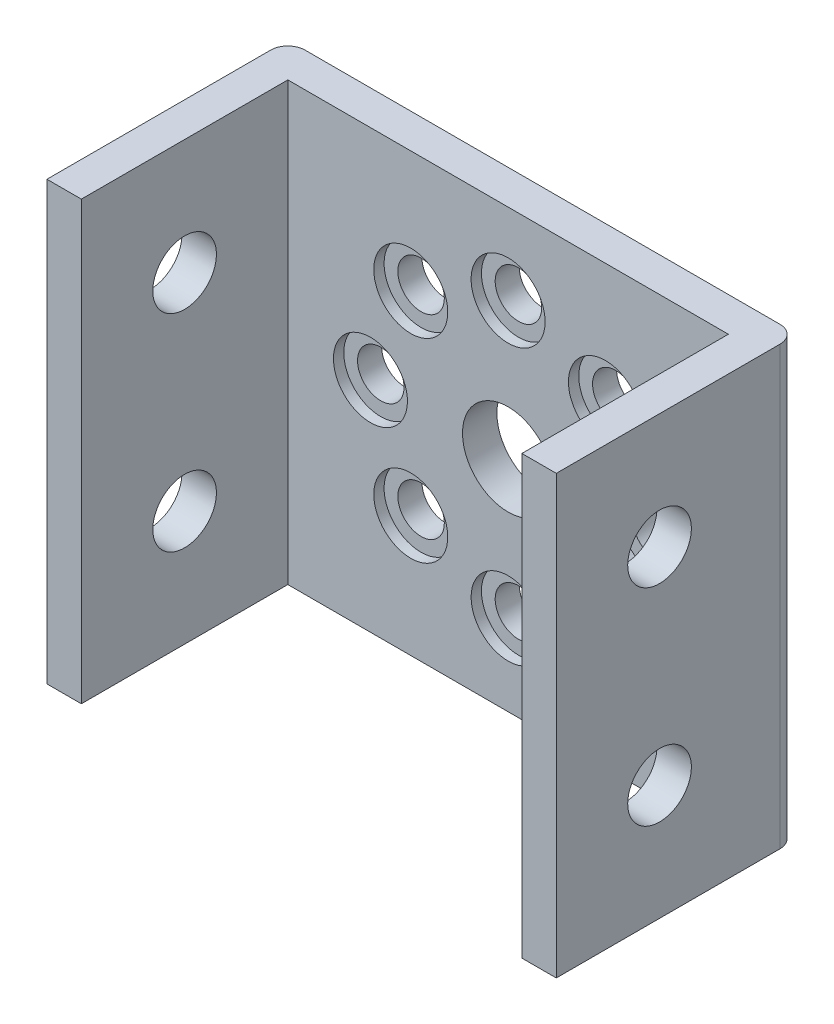
ISO-10303-21;
HEADER;
FILE_DESCRIPTION(('STEP AP214'),'2;1');
FILE_NAME('part.step','',(''),(''),'','','');
FILE_SCHEMA(('AUTOMOTIVE_DESIGN { 1 0 10303 214 1 1 1 1 }'));
ENDSEC;
DATA;
#1=APPLICATION_CONTEXT('core data for automotive mechanical design processes');
#2=APPLICATION_PROTOCOL_DEFINITION('international standard','automotive_design',2000,#1);
#3=PRODUCT_CONTEXT('',#1,'mechanical');
#4=PRODUCT('Part','Part','',(#3));
#5=PRODUCT_RELATED_PRODUCT_CATEGORY('part','',(#4));
#6=PRODUCT_DEFINITION_FORMATION('','',#4);
#7=PRODUCT_DEFINITION_CONTEXT('part definition',#1,'design');
#8=PRODUCT_DEFINITION('design','',#6,#7);
#9=PRODUCT_DEFINITION_SHAPE('','',#8);
#10=(LENGTH_UNIT() NAMED_UNIT(*) SI_UNIT(.MILLI.,.METRE.));
#11=(NAMED_UNIT(*) PLANE_ANGLE_UNIT() SI_UNIT($,.RADIAN.));
#12=(NAMED_UNIT(*) SI_UNIT($,.STERADIAN.) SOLID_ANGLE_UNIT());
#13=UNCERTAINTY_MEASURE_WITH_UNIT(LENGTH_MEASURE(1.E-05),#10,'distance_accuracy_value','');
#14=(GEOMETRIC_REPRESENTATION_CONTEXT(3) GLOBAL_UNCERTAINTY_ASSIGNED_CONTEXT((#13)) GLOBAL_UNIT_ASSIGNED_CONTEXT((#10,
#11,#12)) REPRESENTATION_CONTEXT('',''));
#15=CARTESIAN_POINT('',(0.,0.,0.));
#16=DIRECTION('',(0.,0.,1.));
#17=DIRECTION('',(1.,0.,0.));
#18=AXIS2_PLACEMENT_3D('',#15,#16,#17);
#19=CARTESIAN_POINT('',(-5.65685424949231,5.65685424949245,0.));
#20=DIRECTION('',(0.,0.,1.));
#21=DIRECTION('',(1.,0.,0.));
#22=AXIS2_PLACEMENT_3D('',#19,#20,#21);
#23=CYLINDRICAL_SURFACE('',#22,1.35);
#24=CARTESIAN_POINT('',(-5.65685424949231,5.65685424949245,0.));
#25=DIRECTION('',(0.,0.,1.));
#26=DIRECTION('',(0.707106781186556,0.707106781186539,0.));
#27=AXIS2_PLACEMENT_3D('',#24,#25,#26);
#28=CIRCLE('',#27,1.35);
#29=CARTESIAN_POINT('',(-4.70226009489046,6.61144840409428,0.));
#30=VERTEX_POINT('',#29);
#31=EDGE_CURVE('E148',#30,#30,#28,.T.);
#32=ORIENTED_EDGE('',*,*,#31,.F.);
#33=EDGE_LOOP('',(#32));
#34=FACE_BOUND('',#33,.T.);
#35=CARTESIAN_POINT('',(-5.65685424949231,5.65685424949245,1.40000000000001));
#36=DIRECTION('',(0.,0.,1.));
#37=DIRECTION('',(1.,0.,0.));
#38=AXIS2_PLACEMENT_3D('',#35,#36,#37);
#39=CIRCLE('',#38,1.35);
#40=CARTESIAN_POINT('',(-4.30685424949231,5.65685424949245,1.40000000000001));
#41=VERTEX_POINT('',#40);
#42=EDGE_CURVE('E175',#41,#41,#39,.F.);
#43=ORIENTED_EDGE('',*,*,#42,.F.);
#44=EDGE_LOOP('',(#43));
#45=FACE_BOUND('',#44,.T.);
#46=ADVANCED_FACE('F32',(#34,#45),#23,.F.);
#47=CARTESIAN_POINT('',(-8.,0.,0.));
#48=DIRECTION('',(0.,0.,1.));
#49=DIRECTION('',(1.,0.,0.));
#50=AXIS2_PLACEMENT_3D('',#47,#48,#49);
#51=CYLINDRICAL_SURFACE('',#50,1.35);
#52=CARTESIAN_POINT('',(-8.,0.,0.));
#53=DIRECTION('',(0.,0.,1.));
#54=DIRECTION('',(0.,1.,0.));
#55=AXIS2_PLACEMENT_3D('',#52,#53,#54);
#56=CIRCLE('',#55,1.35);
#57=CARTESIAN_POINT('',(-7.99999999999999,1.35000000000008,0.));
#58=VERTEX_POINT('',#57);
#59=EDGE_CURVE('E300',#58,#58,#56,.T.);
#60=ORIENTED_EDGE('',*,*,#59,.F.);
#61=EDGE_LOOP('',(#60));
#62=FACE_BOUND('',#61,.T.);
#63=CARTESIAN_POINT('',(-8.,0.,1.40000000000001));
#64=DIRECTION('',(0.,0.,1.));
#65=DIRECTION('',(1.,0.,0.));
#66=AXIS2_PLACEMENT_3D('',#63,#64,#65);
#67=CIRCLE('',#66,1.35);
#68=CARTESIAN_POINT('',(-6.65,0.,1.40000000000001));
#69=VERTEX_POINT('',#68);
#70=EDGE_CURVE('E170',#69,#69,#67,.F.);
#71=ORIENTED_EDGE('',*,*,#70,.F.);
#72=EDGE_LOOP('',(#71));
#73=FACE_BOUND('',#72,.T.);
#74=ADVANCED_FACE('F383',(#62,#73),#51,.F.);
#75=CARTESIAN_POINT('',(-5.65685424949243,-5.65685424949233,0.));
#76=DIRECTION('',(0.,0.,1.));
#77=DIRECTION('',(1.,0.,0.));
#78=AXIS2_PLACEMENT_3D('',#75,#76,#77);
#79=CYLINDRICAL_SURFACE('',#78,1.35);
#80=CARTESIAN_POINT('',(-5.65685424949243,-5.65685424949233,0.));
#81=DIRECTION('',(0.,0.,1.));
#82=DIRECTION('',(-0.707106781186541,0.707106781186554,0.));
#83=AXIS2_PLACEMENT_3D('',#80,#81,#82);
#84=CIRCLE('',#83,1.35);
#85=CARTESIAN_POINT('',(-6.61144840409426,-4.70226009489048,0.));
#86=VERTEX_POINT('',#85);
#87=EDGE_CURVE('E297',#86,#86,#84,.T.);
#88=ORIENTED_EDGE('',*,*,#87,.F.);
#89=EDGE_LOOP('',(#88));
#90=FACE_BOUND('',#89,.T.);
#91=CARTESIAN_POINT('',(-5.65685424949243,-5.65685424949233,1.40000000000001));
#92=DIRECTION('',(0.,0.,1.));
#93=DIRECTION('',(1.,0.,0.));
#94=AXIS2_PLACEMENT_3D('',#91,#92,#93);
#95=CIRCLE('',#94,1.35);
#96=CARTESIAN_POINT('',(-4.30685424949243,-5.65685424949233,1.40000000000001));
#97=VERTEX_POINT('',#96);
#98=EDGE_CURVE('E165',#97,#97,#95,.F.);
#99=ORIENTED_EDGE('',*,*,#98,.F.);
#100=EDGE_LOOP('',(#99));
#101=FACE_BOUND('',#100,.T.);
#102=ADVANCED_FACE('F389',(#90,#101),#79,.F.);
#103=CARTESIAN_POINT('',(0.,-8.,0.));
#104=DIRECTION('',(0.,0.,1.));
#105=DIRECTION('',(1.,0.,0.));
#106=AXIS2_PLACEMENT_3D('',#103,#104,#105);
#107=CYLINDRICAL_SURFACE('',#106,1.35);
#108=CARTESIAN_POINT('',(0.,-8.,0.));
#109=DIRECTION('',(0.,0.,1.));
#110=DIRECTION('',(-1.,0.,0.));
#111=AXIS2_PLACEMENT_3D('',#108,#109,#110);
#112=CIRCLE('',#111,1.35);
#113=CARTESIAN_POINT('',(-1.35,-8.,0.));
#114=VERTEX_POINT('',#113);
#115=EDGE_CURVE('E294',#114,#114,#112,.T.);
#116=ORIENTED_EDGE('',*,*,#115,.F.);
#117=EDGE_LOOP('',(#116));
#118=FACE_BOUND('',#117,.T.);
#119=CARTESIAN_POINT('',(0.,-8.,1.40000000000001));
#120=DIRECTION('',(0.,0.,1.));
#121=DIRECTION('',(1.,0.,0.));
#122=AXIS2_PLACEMENT_3D('',#119,#120,#121);
#123=CIRCLE('',#122,1.35);
#124=CARTESIAN_POINT('',(1.35,-8.,1.40000000000001));
#125=VERTEX_POINT('',#124);
#126=EDGE_CURVE('E160',#125,#125,#123,.F.);
#127=ORIENTED_EDGE('',*,*,#126,.F.);
#128=EDGE_LOOP('',(#127));
#129=FACE_BOUND('',#128,.T.);
#130=ADVANCED_FACE('F400',(#118,#129),#107,.F.);
#131=CARTESIAN_POINT('',(5.65685424949235,-5.65685424949241,0.));
#132=DIRECTION('',(0.,0.,1.));
#133=DIRECTION('',(1.,0.,0.));
#134=AXIS2_PLACEMENT_3D('',#131,#132,#133);
#135=CYLINDRICAL_SURFACE('',#134,1.35);
#136=CARTESIAN_POINT('',(5.65685424949235,-5.65685424949241,0.));
#137=DIRECTION('',(0.,0.,1.));
#138=DIRECTION('',(-0.707106781186551,-0.707106781186544,0.));
#139=AXIS2_PLACEMENT_3D('',#136,#137,#138);
#140=CIRCLE('',#139,1.35);
#141=CARTESIAN_POINT('',(4.70226009489051,-6.61144840409424,0.));
#142=VERTEX_POINT('',#141);
#143=EDGE_CURVE('E291',#142,#142,#140,.T.);
#144=ORIENTED_EDGE('',*,*,#143,.F.);
#145=EDGE_LOOP('',(#144));
#146=FACE_BOUND('',#145,.T.);
#147=CARTESIAN_POINT('',(5.65685424949235,-5.65685424949241,1.40000000000001));
#148=DIRECTION('',(0.,0.,1.));
#149=DIRECTION('',(1.,0.,0.));
#150=AXIS2_PLACEMENT_3D('',#147,#148,#149);
#151=CIRCLE('',#150,1.35);
#152=CARTESIAN_POINT('',(7.00685424949235,-5.65685424949241,1.40000000000001));
#153=VERTEX_POINT('',#152);
#154=EDGE_CURVE('E155',#153,#153,#151,.F.);
#155=ORIENTED_EDGE('',*,*,#154,.F.);
#156=EDGE_LOOP('',(#155));
#157=FACE_BOUND('',#156,.T.);
#158=ADVANCED_FACE('F404',(#146,#157),#135,.F.);
#159=CARTESIAN_POINT('',(8.,0.,0.));
#160=DIRECTION('',(0.,0.,1.));
#161=DIRECTION('',(1.,0.,0.));
#162=AXIS2_PLACEMENT_3D('',#159,#160,#161);
#163=CYLINDRICAL_SURFACE('',#162,1.35);
#164=CARTESIAN_POINT('',(8.,0.,0.));
#165=DIRECTION('',(0.,0.,1.));
#166=DIRECTION('',(0.,-1.,0.));
#167=AXIS2_PLACEMENT_3D('',#164,#165,#166);
#168=CIRCLE('',#167,1.35);
#169=CARTESIAN_POINT('',(7.99999999999999,-1.35000000000003,0.));
#170=VERTEX_POINT('',#169);
#171=EDGE_CURVE('E288',#170,#170,#168,.T.);
#172=ORIENTED_EDGE('',*,*,#171,.F.);
#173=EDGE_LOOP('',(#172));
#174=FACE_BOUND('',#173,.T.);
#175=CARTESIAN_POINT('',(8.,0.,1.40000000000001));
#176=DIRECTION('',(0.,0.,1.));
#177=DIRECTION('',(1.,0.,0.));
#178=AXIS2_PLACEMENT_3D('',#175,#176,#177);
#179=CIRCLE('',#178,1.35);
#180=CARTESIAN_POINT('',(9.35,0.,1.40000000000001));
#181=VERTEX_POINT('',#180);
#182=EDGE_CURVE('E150',#181,#181,#179,.F.);
#183=ORIENTED_EDGE('',*,*,#182,.F.);
#184=EDGE_LOOP('',(#183));
#185=FACE_BOUND('',#184,.T.);
#186=ADVANCED_FACE('F408',(#174,#185),#163,.F.);
#187=CARTESIAN_POINT('',(5.65685424949239,5.65685424949237,0.));
#188=DIRECTION('',(0.,0.,1.));
#189=DIRECTION('',(1.,0.,0.));
#190=AXIS2_PLACEMENT_3D('',#187,#188,#189);
#191=CYLINDRICAL_SURFACE('',#190,1.35);
#192=CARTESIAN_POINT('',(5.65685424949239,5.65685424949237,0.));
#193=DIRECTION('',(0.,0.,1.));
#194=DIRECTION('',(0.707106781186546,-0.707106781186549,0.));
#195=AXIS2_PLACEMENT_3D('',#192,#193,#194);
#196=CIRCLE('',#195,1.35);
#197=CARTESIAN_POINT('',(6.61144840409423,4.70226009489053,0.));
#198=VERTEX_POINT('',#197);
#199=EDGE_CURVE('E283',#198,#198,#196,.T.);
#200=ORIENTED_EDGE('',*,*,#199,.F.);
#201=EDGE_LOOP('',(#200));
#202=FACE_BOUND('',#201,.T.);
#203=CARTESIAN_POINT('',(5.65685424949239,5.65685424949237,1.40000000000001));
#204=DIRECTION('',(0.,0.,1.));
#205=DIRECTION('',(1.,0.,0.));
#206=AXIS2_PLACEMENT_3D('',#203,#204,#205);
#207=CIRCLE('',#206,1.35);
#208=CARTESIAN_POINT('',(7.00685424949239,5.65685424949237,1.40000000000001));
#209=VERTEX_POINT('',#208);
#210=EDGE_CURVE('E145',#209,#209,#207,.F.);
#211=ORIENTED_EDGE('',*,*,#210,.F.);
#212=EDGE_LOOP('',(#211));
#213=FACE_BOUND('',#212,.T.);
#214=ADVANCED_FACE('F412',(#202,#213),#191,.F.);
#215=CARTESIAN_POINT('',(0.,8.,0.));
#216=DIRECTION('',(0.,0.,1.));
#217=DIRECTION('',(1.,0.,0.));
#218=AXIS2_PLACEMENT_3D('',#215,#216,#217);
#219=CYLINDRICAL_SURFACE('',#218,1.35);
#220=CARTESIAN_POINT('',(0.,8.,0.));
#221=DIRECTION('',(0.,0.,1.));
#222=DIRECTION('',(1.,0.,0.));
#223=AXIS2_PLACEMENT_3D('',#220,#221,#222);
#224=CIRCLE('',#223,1.35);
#225=CARTESIAN_POINT('',(1.35,8.,0.));
#226=VERTEX_POINT('',#225);
#227=EDGE_CURVE('E143',#226,#226,#224,.T.);
#228=ORIENTED_EDGE('',*,*,#227,.F.);
#229=EDGE_LOOP('',(#228));
#230=FACE_BOUND('',#229,.T.);
#231=CARTESIAN_POINT('',(0.,8.,1.40000000000001));
#232=DIRECTION('',(0.,0.,1.));
#233=DIRECTION('',(1.,0.,0.));
#234=AXIS2_PLACEMENT_3D('',#231,#232,#233);
#235=CIRCLE('',#234,1.35);
#236=CARTESIAN_POINT('',(1.35,8.,1.40000000000001));
#237=VERTEX_POINT('',#236);
#238=EDGE_CURVE('E140',#237,#237,#235,.F.);
#239=ORIENTED_EDGE('',*,*,#238,.F.);
#240=EDGE_LOOP('',(#239));
#241=FACE_BOUND('',#240,.T.);
#242=ADVANCED_FACE('F415',(#230,#241),#219,.F.);
#243=CARTESIAN_POINT('',(-14.8,12.7,14.));
#244=DIRECTION('',(1.,0.,0.));
#245=DIRECTION('',(0.,0.,-1.));
#246=AXIS2_PLACEMENT_3D('',#243,#244,#245);
#247=PLANE('',#246);
#248=CARTESIAN_POINT('',(-14.8,6.,8.));
#249=DIRECTION('',(-1.,0.,0.));
#250=DIRECTION('',(0.,0.,1.));
#251=AXIS2_PLACEMENT_3D('',#248,#249,#250);
#252=CIRCLE('',#251,1.85);
#253=CARTESIAN_POINT('',(-14.8,6.,9.85));
#254=VERTEX_POINT('',#253);
#255=EDGE_CURVE('E267',#254,#254,#252,.T.);
#256=ORIENTED_EDGE('',*,*,#255,.F.);
#257=EDGE_LOOP('',(#256));
#258=FACE_BOUND('',#257,.T.);
#259=CARTESIAN_POINT('',(-14.8,-6.,8.));
#260=DIRECTION('',(-1.,0.,0.));
#261=DIRECTION('',(0.,0.,1.));
#262=AXIS2_PLACEMENT_3D('',#259,#260,#261);
#263=CIRCLE('',#262,1.85);
#264=CARTESIAN_POINT('',(-14.8,-6.,9.85));
#265=VERTEX_POINT('',#264);
#266=EDGE_CURVE('E255',#265,#265,#263,.T.);
#267=ORIENTED_EDGE('',*,*,#266,.F.);
#268=EDGE_LOOP('',(#267));
#269=FACE_BOUND('',#268,.T.);
#270=DIRECTION('',(0.,0.,1.));
#271=VECTOR('',#270,1.);
#272=CARTESIAN_POINT('',(-14.8,12.7,14.));
#273=LINE('',#272,#271);
#274=CARTESIAN_POINT('',(-14.8,12.7,0.999999999999999));
#275=VERTEX_POINT('',#274);
#276=CARTESIAN_POINT('',(-14.8,12.7,14.));
#277=VERTEX_POINT('',#276);
#278=EDGE_CURVE('E109',#275,#277,#273,.T.);
#279=ORIENTED_EDGE('',*,*,#278,.F.);
#280=DIRECTION('',(0.,-1.,0.));
#281=VECTOR('',#280,1.);
#282=CARTESIAN_POINT('',(-14.8,12.7,0.999999999999999));
#283=LINE('',#282,#281);
#284=CARTESIAN_POINT('',(-14.8,-12.7,0.999999999999999));
#285=VERTEX_POINT('',#284);
#286=EDGE_CURVE('E11',#275,#285,#283,.T.);
#287=ORIENTED_EDGE('',*,*,#286,.T.);
#288=DIRECTION('',(0.,0.,1.));
#289=VECTOR('',#288,1.);
#290=CARTESIAN_POINT('',(-14.8,-12.7,14.));
#291=LINE('',#290,#289);
#292=CARTESIAN_POINT('',(-14.8,-12.7,14.));
#293=VERTEX_POINT('',#292);
#294=EDGE_CURVE('E130',#285,#293,#291,.T.);
#295=ORIENTED_EDGE('',*,*,#294,.T.);
#296=DIRECTION('',(0.,-1.,0.));
#297=VECTOR('',#296,1.);
#298=CARTESIAN_POINT('',(-14.8,12.7,14.));
#299=LINE('',#298,#297);
#300=EDGE_CURVE('E122',#277,#293,#299,.T.);
#301=ORIENTED_EDGE('',*,*,#300,.F.);
#302=EDGE_LOOP('',(#279,#287,#295,#301));
#303=FACE_BOUND('',#302,.T.);
#304=ADVANCED_FACE('F128',(#258,#269,#303),#247,.F.);
#305=CARTESIAN_POINT('',(-12.8,12.7,14.));
#306=DIRECTION('',(0.,0.,-1.));
#307=DIRECTION('',(-1.,0.,0.));
#308=AXIS2_PLACEMENT_3D('',#305,#306,#307);
#309=PLANE('',#308);
#310=DIRECTION('',(1.,0.,0.));
#311=VECTOR('',#310,1.);
#312=CARTESIAN_POINT('',(-12.8,-12.7,14.));
#313=LINE('',#312,#311);
#314=CARTESIAN_POINT('',(-12.8,-12.7,14.));
#315=VERTEX_POINT('',#314);
#316=EDGE_CURVE('E236',#293,#315,#313,.T.);
#317=ORIENTED_EDGE('',*,*,#316,.T.);
#318=DIRECTION('',(0.,-1.,0.));
#319=VECTOR('',#318,1.);
#320=CARTESIAN_POINT('',(-12.8,12.7,14.));
#321=LINE('',#320,#319);
#322=CARTESIAN_POINT('',(-12.8,12.7,14.));
#323=VERTEX_POINT('',#322);
#324=EDGE_CURVE('E124',#323,#315,#321,.T.);
#325=ORIENTED_EDGE('',*,*,#324,.F.);
#326=DIRECTION('',(1.,0.,0.));
#327=VECTOR('',#326,1.);
#328=CARTESIAN_POINT('',(-12.8,12.7,14.));
#329=LINE('',#328,#327);
#330=EDGE_CURVE('E112',#277,#323,#329,.T.);
#331=ORIENTED_EDGE('',*,*,#330,.F.);
#332=ORIENTED_EDGE('',*,*,#300,.T.);
#333=EDGE_LOOP('',(#317,#325,#331,#332));
#334=FACE_BOUND('',#333,.T.);
#335=ADVANCED_FACE('F121',(#334),#309,.F.);
#336=CARTESIAN_POINT('',(-12.8,12.7,2.));
#337=DIRECTION('',(-1.,0.,0.));
#338=DIRECTION('',(0.,0.,1.));
#339=AXIS2_PLACEMENT_3D('',#336,#337,#338);
#340=PLANE('',#339);
#341=CARTESIAN_POINT('',(-12.8,6.,8.));
#342=DIRECTION('',(-1.,0.,0.));
#343=DIRECTION('',(0.,0.,1.));
#344=AXIS2_PLACEMENT_3D('',#341,#342,#343);
#345=CIRCLE('',#344,1.85);
#346=CARTESIAN_POINT('',(-12.8,6.,9.85));
#347=VERTEX_POINT('',#346);
#348=EDGE_CURVE('E258',#347,#347,#345,.T.);
#349=ORIENTED_EDGE('',*,*,#348,.T.);
#350=EDGE_LOOP('',(#349));
#351=FACE_BOUND('',#350,.T.);
#352=CARTESIAN_POINT('',(-12.8,-6.,8.));
#353=DIRECTION('',(-1.,0.,0.));
#354=DIRECTION('',(0.,0.,1.));
#355=AXIS2_PLACEMENT_3D('',#352,#353,#354);
#356=CIRCLE('',#355,1.85);
#357=CARTESIAN_POINT('',(-12.8,-6.,9.85));
#358=VERTEX_POINT('',#357);
#359=EDGE_CURVE('E240',#358,#358,#356,.T.);
#360=ORIENTED_EDGE('',*,*,#359,.T.);
#361=EDGE_LOOP('',(#360));
#362=FACE_BOUND('',#361,.T.);
#363=DIRECTION('',(0.,0.,-1.));
#364=VECTOR('',#363,1.);
#365=CARTESIAN_POINT('',(-12.8,-12.7,2.));
#366=LINE('',#365,#364);
#367=CARTESIAN_POINT('',(-12.8,-12.7,2.));
#368=VERTEX_POINT('',#367);
#369=EDGE_CURVE('E234',#315,#368,#366,.T.);
#370=ORIENTED_EDGE('',*,*,#369,.T.);
#371=DIRECTION('',(0.,-1.,0.));
#372=VECTOR('',#371,1.);
#373=CARTESIAN_POINT('',(-12.8,12.7,2.));
#374=LINE('',#373,#372);
#375=CARTESIAN_POINT('',(-12.8,12.7,2.));
#376=VERTEX_POINT('',#375);
#377=EDGE_CURVE('E136',#376,#368,#374,.T.);
#378=ORIENTED_EDGE('',*,*,#377,.F.);
#379=DIRECTION('',(0.,0.,-1.));
#380=VECTOR('',#379,1.);
#381=CARTESIAN_POINT('',(-12.8,12.7,2.));
#382=LINE('',#381,#380);
#383=EDGE_CURVE('E126',#323,#376,#382,.T.);
#384=ORIENTED_EDGE('',*,*,#383,.F.);
#385=ORIENTED_EDGE('',*,*,#324,.T.);
#386=EDGE_LOOP('',(#370,#378,#384,#385));
#387=FACE_BOUND('',#386,.T.);
#388=ADVANCED_FACE('F347',(#351,#362,#387),#340,.F.);
#389=CARTESIAN_POINT('',(12.8,12.7,2.00000000000002));
#390=DIRECTION('',(0.,0.,-1.));
#391=DIRECTION('',(-1.,0.,0.));
#392=AXIS2_PLACEMENT_3D('',#389,#390,#391);
#393=PLANE('',#392);
#394=CARTESIAN_POINT('',(-5.65685424949231,5.65685424949245,2.00000000000001));
#395=DIRECTION('',(0.,0.,1.));
#396=DIRECTION('',(0.707106781186556,0.707106781186539,0.));
#397=AXIS2_PLACEMENT_3D('',#394,#395,#396);
#398=CIRCLE('',#397,2.15);
#399=CARTESIAN_POINT('',(-4.13657466994122,7.17713382904351,2.00000000000001));
#400=VERTEX_POINT('',#399);
#401=EDGE_CURVE('E329',#400,#400,#398,.T.);
#402=ORIENTED_EDGE('',*,*,#401,.F.);
#403=EDGE_LOOP('',(#402));
#404=FACE_BOUND('',#403,.T.);
#405=CARTESIAN_POINT('',(-8.,0.,2.00000000000001));
#406=DIRECTION('',(0.,0.,1.));
#407=DIRECTION('',(0.,1.,0.));
#408=AXIS2_PLACEMENT_3D('',#405,#406,#407);
#409=CIRCLE('',#408,2.15);
#410=CARTESIAN_POINT('',(-7.99999999999998,2.15000000000008,2.00000000000001));
#411=VERTEX_POINT('',#410);
#412=EDGE_CURVE('E177',#411,#411,#409,.T.);
#413=ORIENTED_EDGE('',*,*,#412,.F.);
#414=EDGE_LOOP('',(#413));
#415=FACE_BOUND('',#414,.T.);
#416=CARTESIAN_POINT('',(-5.65685424949243,-5.65685424949233,2.00000000000001));
#417=DIRECTION('',(0.,0.,1.));
#418=DIRECTION('',(-0.707106781186541,0.707106781186554,0.));
#419=AXIS2_PLACEMENT_3D('',#416,#417,#418);
#420=CIRCLE('',#419,2.15);
#421=CARTESIAN_POINT('',(-7.17713382904349,-4.13657466994124,2.00000000000001));
#422=VERTEX_POINT('',#421);
#423=EDGE_CURVE('E173',#422,#422,#420,.T.);
#424=ORIENTED_EDGE('',*,*,#423,.F.);
#425=EDGE_LOOP('',(#424));
#426=FACE_BOUND('',#425,.T.);
#427=CARTESIAN_POINT('',(0.,-8.,2.00000000000001));
#428=DIRECTION('',(0.,0.,1.));
#429=DIRECTION('',(-1.,0.,0.));
#430=AXIS2_PLACEMENT_3D('',#427,#428,#429);
#431=CIRCLE('',#430,2.15);
#432=CARTESIAN_POINT('',(-2.15,-8.,2.00000000000001));
#433=VERTEX_POINT('',#432);
#434=EDGE_CURVE('E168',#433,#433,#431,.T.);
#435=ORIENTED_EDGE('',*,*,#434,.F.);
#436=EDGE_LOOP('',(#435));
#437=FACE_BOUND('',#436,.T.);
#438=CARTESIAN_POINT('',(5.65685424949235,-5.65685424949241,2.00000000000001));
#439=DIRECTION('',(0.,0.,1.));
#440=DIRECTION('',(-0.707106781186551,-0.707106781186544,0.));
#441=AXIS2_PLACEMENT_3D('',#438,#439,#440);
#442=CIRCLE('',#441,2.15);
#443=CARTESIAN_POINT('',(4.13657466994127,-7.17713382904348,2.00000000000001));
#444=VERTEX_POINT('',#443);
#445=EDGE_CURVE('E163',#444,#444,#442,.T.);
#446=ORIENTED_EDGE('',*,*,#445,.F.);
#447=EDGE_LOOP('',(#446));
#448=FACE_BOUND('',#447,.T.);
#449=CARTESIAN_POINT('',(8.,0.,2.00000000000001));
#450=DIRECTION('',(0.,0.,1.));
#451=DIRECTION('',(0.,-1.,0.));
#452=AXIS2_PLACEMENT_3D('',#449,#450,#451);
#453=CIRCLE('',#452,2.15);
#454=CARTESIAN_POINT('',(7.99999999999999,-2.15000000000003,2.00000000000001));
#455=VERTEX_POINT('',#454);
#456=EDGE_CURVE('E158',#455,#455,#453,.T.);
#457=ORIENTED_EDGE('',*,*,#456,.F.);
#458=EDGE_LOOP('',(#457));
#459=FACE_BOUND('',#458,.T.);
#460=CARTESIAN_POINT('',(5.65685424949239,5.65685424949237,2.00000000000001));
#461=DIRECTION('',(0.,0.,1.));
#462=DIRECTION('',(0.707106781186546,-0.707106781186549,0.));
#463=AXIS2_PLACEMENT_3D('',#460,#461,#462);
#464=CIRCLE('',#463,2.15);
#465=CARTESIAN_POINT('',(7.17713382904346,4.13657466994129,2.00000000000001));
#466=VERTEX_POINT('',#465);
#467=EDGE_CURVE('E153',#466,#466,#464,.T.);
#468=ORIENTED_EDGE('',*,*,#467,.F.);
#469=EDGE_LOOP('',(#468));
#470=FACE_BOUND('',#469,.T.);
#471=CARTESIAN_POINT('',(0.,8.,2.00000000000001));
#472=DIRECTION('',(0.,0.,1.));
#473=DIRECTION('',(1.,0.,0.));
#474=AXIS2_PLACEMENT_3D('',#471,#472,#473);
#475=CIRCLE('',#474,2.15);
#476=CARTESIAN_POINT('',(2.15,8.,2.00000000000001));
#477=VERTEX_POINT('',#476);
#478=EDGE_CURVE('E280',#477,#477,#475,.T.);
#479=ORIENTED_EDGE('',*,*,#478,.F.);
#480=EDGE_LOOP('',(#479));
#481=FACE_BOUND('',#480,.T.);
#482=CARTESIAN_POINT('',(0.,0.,2.00000000000001));
#483=DIRECTION('',(0.,0.,-1.));
#484=DIRECTION('',(-1.,0.,0.));
#485=AXIS2_PLACEMENT_3D('',#482,#483,#484);
#486=CIRCLE('',#485,2.65);
#487=CARTESIAN_POINT('',(-2.65,0.,2.00000000000001));
#488=VERTEX_POINT('',#487);
#489=EDGE_CURVE('E270',#488,#488,#486,.T.);
#490=ORIENTED_EDGE('',*,*,#489,.T.);
#491=EDGE_LOOP('',(#490));
#492=FACE_BOUND('',#491,.T.);
#493=DIRECTION('',(1.,0.,0.));
#494=VECTOR('',#493,1.);
#495=CARTESIAN_POINT('',(12.8,-12.7,2.00000000000002));
#496=LINE('',#495,#494);
#497=CARTESIAN_POINT('',(12.8,-12.7,2.00000000000002));
#498=VERTEX_POINT('',#497);
#499=EDGE_CURVE('E229',#368,#498,#496,.T.);
#500=ORIENTED_EDGE('',*,*,#499,.T.);
#501=DIRECTION('',(0.,-1.,0.));
#502=VECTOR('',#501,1.);
#503=CARTESIAN_POINT('',(12.8,12.7,2.00000000000002));
#504=LINE('',#503,#502);
#505=CARTESIAN_POINT('',(12.8,12.7,2.00000000000002));
#506=VERTEX_POINT('',#505);
#507=EDGE_CURVE('E220',#506,#498,#504,.T.);
#508=ORIENTED_EDGE('',*,*,#507,.F.);
#509=DIRECTION('',(1.,0.,0.));
#510=VECTOR('',#509,1.);
#511=CARTESIAN_POINT('',(12.8,12.7,2.00000000000002));
#512=LINE('',#511,#510);
#513=EDGE_CURVE('E230',#376,#506,#512,.T.);
#514=ORIENTED_EDGE('',*,*,#513,.F.);
#515=ORIENTED_EDGE('',*,*,#377,.T.);
#516=EDGE_LOOP('',(#500,#508,#514,#515));
#517=FACE_BOUND('',#516,.T.);
#518=ADVANCED_FACE('F227',(#404,#415,#426,#437,#448,#459,#470,#481,#492,#517),#393,.F.);
#519=CARTESIAN_POINT('',(12.8,12.7,14.));
#520=DIRECTION('',(1.,0.,0.));
#521=DIRECTION('',(0.,0.,-1.));
#522=AXIS2_PLACEMENT_3D('',#519,#520,#521);
#523=PLANE('',#522);
#524=CARTESIAN_POINT('',(12.8,6.,8.));
#525=DIRECTION('',(1.,0.,0.));
#526=DIRECTION('',(0.,0.,-1.));
#527=AXIS2_PLACEMENT_3D('',#524,#525,#526);
#528=CIRCLE('',#527,1.85);
#529=CARTESIAN_POINT('',(12.8,6.,6.15));
#530=VERTEX_POINT('',#529);
#531=EDGE_CURVE('E263',#530,#530,#528,.T.);
#532=ORIENTED_EDGE('',*,*,#531,.T.);
#533=EDGE_LOOP('',(#532));
#534=FACE_BOUND('',#533,.T.);
#535=CARTESIAN_POINT('',(12.8,-6.,8.));
#536=DIRECTION('',(1.,0.,0.));
#537=DIRECTION('',(0.,0.,-1.));
#538=AXIS2_PLACEMENT_3D('',#535,#536,#537);
#539=CIRCLE('',#538,1.85);
#540=CARTESIAN_POINT('',(12.8,-6.,6.15));
#541=VERTEX_POINT('',#540);
#542=EDGE_CURVE('E251',#541,#541,#539,.T.);
#543=ORIENTED_EDGE('',*,*,#542,.T.);
#544=EDGE_LOOP('',(#543));
#545=FACE_BOUND('',#544,.T.);
#546=DIRECTION('',(0.,0.,1.));
#547=VECTOR('',#546,1.);
#548=CARTESIAN_POINT('',(12.8,-12.7,14.));
#549=LINE('',#548,#547);
#550=CARTESIAN_POINT('',(12.8,-12.7,14.));
#551=VERTEX_POINT('',#550);
#552=EDGE_CURVE('E212',#498,#551,#549,.T.);
#553=ORIENTED_EDGE('',*,*,#552,.T.);
#554=DIRECTION('',(0.,-1.,0.));
#555=VECTOR('',#554,1.);
#556=CARTESIAN_POINT('',(12.8,12.7,14.));
#557=LINE('',#556,#555);
#558=CARTESIAN_POINT('',(12.8,12.7,14.));
#559=VERTEX_POINT('',#558);
#560=EDGE_CURVE('E217',#559,#551,#557,.T.);
#561=ORIENTED_EDGE('',*,*,#560,.F.);
#562=DIRECTION('',(0.,0.,1.));
#563=VECTOR('',#562,1.);
#564=CARTESIAN_POINT('',(12.8,12.7,14.));
#565=LINE('',#564,#563);
#566=EDGE_CURVE('E245',#506,#559,#565,.T.);
#567=ORIENTED_EDGE('',*,*,#566,.F.);
#568=ORIENTED_EDGE('',*,*,#507,.T.);
#569=EDGE_LOOP('',(#553,#561,#567,#568));
#570=FACE_BOUND('',#569,.T.);
#571=ADVANCED_FACE('F346',(#534,#545,#570),#523,.F.);
#572=CARTESIAN_POINT('',(14.8,12.7,14.));
#573=DIRECTION('',(0.,0.,-1.));
#574=DIRECTION('',(-1.,0.,0.));
#575=AXIS2_PLACEMENT_3D('',#572,#573,#574);
#576=PLANE('',#575);
#577=DIRECTION('',(1.,0.,0.));
#578=VECTOR('',#577,1.);
#579=CARTESIAN_POINT('',(14.8,-12.7,14.));
#580=LINE('',#579,#578);
#581=CARTESIAN_POINT('',(14.8,-12.7,14.));
#582=VERTEX_POINT('',#581);
#583=EDGE_CURVE('E209',#551,#582,#580,.T.);
#584=ORIENTED_EDGE('',*,*,#583,.T.);
#585=DIRECTION('',(0.,-1.,0.));
#586=VECTOR('',#585,1.);
#587=CARTESIAN_POINT('',(14.8,12.7,14.));
#588=LINE('',#587,#586);
#589=CARTESIAN_POINT('',(14.8,12.7,14.));
#590=VERTEX_POINT('',#589);
#591=EDGE_CURVE('E198',#590,#582,#588,.T.);
#592=ORIENTED_EDGE('',*,*,#591,.F.);
#593=DIRECTION('',(1.,0.,0.));
#594=VECTOR('',#593,1.);
#595=CARTESIAN_POINT('',(14.8,12.7,14.));
#596=LINE('',#595,#594);
#597=EDGE_CURVE('E243',#559,#590,#596,.T.);
#598=ORIENTED_EDGE('',*,*,#597,.F.);
#599=ORIENTED_EDGE('',*,*,#560,.T.);
#600=EDGE_LOOP('',(#584,#592,#598,#599));
#601=FACE_BOUND('',#600,.T.);
#602=ADVANCED_FACE('F443',(#601),#576,.F.);
#603=CARTESIAN_POINT('',(14.8,12.7,0.));
#604=DIRECTION('',(-1.,0.,0.));
#605=DIRECTION('',(0.,0.,1.));
#606=AXIS2_PLACEMENT_3D('',#603,#604,#605);
#607=PLANE('',#606);
#608=CARTESIAN_POINT('',(14.8,6.,8.));
#609=DIRECTION('',(-1.,0.,0.));
#610=DIRECTION('',(0.,0.,1.));
#611=AXIS2_PLACEMENT_3D('',#608,#609,#610);
#612=CIRCLE('',#611,1.85);
#613=CARTESIAN_POINT('',(14.8,6.,9.85));
#614=VERTEX_POINT('',#613);
#615=EDGE_CURVE('E266',#614,#614,#612,.T.);
#616=ORIENTED_EDGE('',*,*,#615,.T.);
#617=EDGE_LOOP('',(#616));
#618=FACE_BOUND('',#617,.T.);
#619=CARTESIAN_POINT('',(14.8,-6.,8.));
#620=DIRECTION('',(-1.,0.,0.));
#621=DIRECTION('',(0.,0.,1.));
#622=AXIS2_PLACEMENT_3D('',#619,#620,#621);
#623=CIRCLE('',#622,1.85);
#624=CARTESIAN_POINT('',(14.8,-6.,9.85));
#625=VERTEX_POINT('',#624);
#626=EDGE_CURVE('E254',#625,#625,#623,.T.);
#627=ORIENTED_EDGE('',*,*,#626,.T.);
#628=EDGE_LOOP('',(#627));
#629=FACE_BOUND('',#628,.T.);
#630=DIRECTION('',(0.,0.,-1.));
#631=VECTOR('',#630,1.);
#632=CARTESIAN_POINT('',(14.8,-12.7,0.));
#633=LINE('',#632,#631);
#634=CARTESIAN_POINT('',(14.8,-12.7,1.));
#635=VERTEX_POINT('',#634);
#636=EDGE_CURVE('E205',#582,#635,#633,.T.);
#637=ORIENTED_EDGE('',*,*,#636,.T.);
#638=DIRECTION('',(0.,-1.,0.));
#639=VECTOR('',#638,1.);
#640=CARTESIAN_POINT('',(14.8,12.7,1.));
#641=LINE('',#640,#639);
#642=CARTESIAN_POINT('',(14.8,12.7,1.));
#643=VERTEX_POINT('',#642);
#644=EDGE_CURVE('E55',#635,#643,#641,.F.);
#645=ORIENTED_EDGE('',*,*,#644,.T.);
#646=DIRECTION('',(0.,0.,-1.));
#647=VECTOR('',#646,1.);
#648=CARTESIAN_POINT('',(14.8,12.7,0.));
#649=LINE('',#648,#647);
#650=EDGE_CURVE('E190',#590,#643,#649,.T.);
#651=ORIENTED_EDGE('',*,*,#650,.F.);
#652=ORIENTED_EDGE('',*,*,#591,.T.);
#653=EDGE_LOOP('',(#637,#645,#651,#652));
#654=FACE_BOUND('',#653,.T.);
#655=ADVANCED_FACE('F207',(#618,#629,#654),#607,.F.);
#656=CARTESIAN_POINT('',(-14.8,12.7,0.));
#657=DIRECTION('',(0.,0.,1.));
#658=DIRECTION('',(1.,0.,0.));
#659=AXIS2_PLACEMENT_3D('',#656,#657,#658);
#660=PLANE('',#659);
#661=ORIENTED_EDGE('',*,*,#31,.T.);
#662=EDGE_LOOP('',(#661));
#663=FACE_BOUND('',#662,.T.);
#664=ORIENTED_EDGE('',*,*,#59,.T.);
#665=EDGE_LOOP('',(#664));
#666=FACE_BOUND('',#665,.T.);
#667=ORIENTED_EDGE('',*,*,#87,.T.);
#668=EDGE_LOOP('',(#667));
#669=FACE_BOUND('',#668,.T.);
#670=ORIENTED_EDGE('',*,*,#115,.T.);
#671=EDGE_LOOP('',(#670));
#672=FACE_BOUND('',#671,.T.);
#673=ORIENTED_EDGE('',*,*,#143,.T.);
#674=EDGE_LOOP('',(#673));
#675=FACE_BOUND('',#674,.T.);
#676=ORIENTED_EDGE('',*,*,#171,.T.);
#677=EDGE_LOOP('',(#676));
#678=FACE_BOUND('',#677,.T.);
#679=ORIENTED_EDGE('',*,*,#199,.T.);
#680=EDGE_LOOP('',(#679));
#681=FACE_BOUND('',#680,.T.);
#682=ORIENTED_EDGE('',*,*,#227,.T.);
#683=EDGE_LOOP('',(#682));
#684=FACE_BOUND('',#683,.T.);
#685=CARTESIAN_POINT('',(0.,0.,0.));
#686=DIRECTION('',(0.,0.,-1.));
#687=DIRECTION('',(-1.,0.,0.));
#688=AXIS2_PLACEMENT_3D('',#685,#686,#687);
#689=CIRCLE('',#688,2.65);
#690=CARTESIAN_POINT('',(-2.65,0.,0.));
#691=VERTEX_POINT('',#690);
#692=EDGE_CURVE('E275',#691,#691,#689,.T.);
#693=ORIENTED_EDGE('',*,*,#692,.F.);
#694=EDGE_LOOP('',(#693));
#695=FACE_BOUND('',#694,.T.);
#696=DIRECTION('',(-1.,0.,0.));
#697=VECTOR('',#696,1.);
#698=CARTESIAN_POINT('',(-14.8,12.7,0.));
#699=LINE('',#698,#697);
#700=CARTESIAN_POINT('',(13.8,12.7,0.));
#701=VERTEX_POINT('',#700);
#702=CARTESIAN_POINT('',(-13.8,12.7,0.));
#703=VERTEX_POINT('',#702);
#704=EDGE_CURVE('E189',#701,#703,#699,.T.);
#705=ORIENTED_EDGE('',*,*,#704,.F.);
#706=DIRECTION('',(0.,-1.,0.));
#707=VECTOR('',#706,1.);
#708=CARTESIAN_POINT('',(13.8,12.7,0.));
#709=LINE('',#708,#707);
#710=CARTESIAN_POINT('',(13.8,-12.7,0.));
#711=VERTEX_POINT('',#710);
#712=EDGE_CURVE('E134',#701,#711,#709,.T.);
#713=ORIENTED_EDGE('',*,*,#712,.T.);
#714=DIRECTION('',(-1.,0.,0.));
#715=VECTOR('',#714,1.);
#716=CARTESIAN_POINT('',(-14.8,-12.7,0.));
#717=LINE('',#716,#715);
#718=CARTESIAN_POINT('',(-13.8,-12.7,0.));
#719=VERTEX_POINT('',#718);
#720=EDGE_CURVE('E117',#711,#719,#717,.T.);
#721=ORIENTED_EDGE('',*,*,#720,.T.);
#722=DIRECTION('',(0.,-1.,0.));
#723=VECTOR('',#722,1.);
#724=CARTESIAN_POINT('',(-13.8,12.7,0.));
#725=LINE('',#724,#723);
#726=EDGE_CURVE('E132',#719,#703,#725,.F.);
#727=ORIENTED_EDGE('',*,*,#726,.T.);
#728=EDGE_LOOP('',(#705,#713,#721,#727));
#729=FACE_BOUND('',#728,.T.);
#730=ADVANCED_FACE('F194',(#663,#666,#669,#672,#675,#678,#681,#684,#695,#729),#660,.F.);
#731=CARTESIAN_POINT('',(0.,12.7,0.));
#732=DIRECTION('',(0.,-1.,0.));
#733=DIRECTION('',(0.,0.,-1.));
#734=AXIS2_PLACEMENT_3D('',#731,#732,#733);
#735=PLANE('',#734);
#736=ORIENTED_EDGE('',*,*,#650,.T.);
#737=CARTESIAN_POINT('',(13.8,12.7,1.));
#738=DIRECTION('',(0.,-1.,0.));
#739=DIRECTION('',(0.,0.,-1.));
#740=AXIS2_PLACEMENT_3D('',#737,#738,#739);
#741=CIRCLE('',#740,1.);
#742=EDGE_CURVE('E40',#643,#701,#741,.F.);
#743=ORIENTED_EDGE('',*,*,#742,.T.);
#744=ORIENTED_EDGE('',*,*,#704,.T.);
#745=CARTESIAN_POINT('',(-13.8,12.7,0.999999999999999));
#746=DIRECTION('',(0.,-1.,0.));
#747=DIRECTION('',(0.,0.,-1.));
#748=AXIS2_PLACEMENT_3D('',#745,#746,#747);
#749=CIRCLE('',#748,1.);
#750=EDGE_CURVE('E47',#703,#275,#749,.F.);
#751=ORIENTED_EDGE('',*,*,#750,.T.);
#752=ORIENTED_EDGE('',*,*,#278,.T.);
#753=ORIENTED_EDGE('',*,*,#330,.T.);
#754=ORIENTED_EDGE('',*,*,#383,.T.);
#755=ORIENTED_EDGE('',*,*,#513,.T.);
#756=ORIENTED_EDGE('',*,*,#566,.T.);
#757=ORIENTED_EDGE('',*,*,#597,.T.);
#758=EDGE_LOOP('',(#736,#743,#744,#751,#752,#753,#754,#755,#756,#757));
#759=FACE_BOUND('',#758,.T.);
#760=ADVANCED_FACE('F111',(#759),#735,.F.);
#761=CARTESIAN_POINT('',(0.,-12.7,0.));
#762=DIRECTION('',(0.,-1.,0.));
#763=DIRECTION('',(0.,0.,-1.));
#764=AXIS2_PLACEMENT_3D('',#761,#762,#763);
#765=PLANE('',#764);
#766=ORIENTED_EDGE('',*,*,#720,.F.);
#767=CARTESIAN_POINT('',(13.8,-12.7,1.));
#768=DIRECTION('',(0.,-1.,0.));
#769=DIRECTION('',(0.,0.,-1.));
#770=AXIS2_PLACEMENT_3D('',#767,#768,#769);
#771=CIRCLE('',#770,1.);
#772=EDGE_CURVE('E184',#711,#635,#771,.T.);
#773=ORIENTED_EDGE('',*,*,#772,.T.);
#774=ORIENTED_EDGE('',*,*,#636,.F.);
#775=ORIENTED_EDGE('',*,*,#583,.F.);
#776=ORIENTED_EDGE('',*,*,#552,.F.);
#777=ORIENTED_EDGE('',*,*,#499,.F.);
#778=ORIENTED_EDGE('',*,*,#369,.F.);
#779=ORIENTED_EDGE('',*,*,#316,.F.);
#780=ORIENTED_EDGE('',*,*,#294,.F.);
#781=CARTESIAN_POINT('',(-13.8,-12.7,0.999999999999999));
#782=DIRECTION('',(0.,-1.,0.));
#783=DIRECTION('',(0.,0.,-1.));
#784=AXIS2_PLACEMENT_3D('',#781,#782,#783);
#785=CIRCLE('',#784,1.);
#786=EDGE_CURVE('E182',#285,#719,#785,.T.);
#787=ORIENTED_EDGE('',*,*,#786,.T.);
#788=EDGE_LOOP('',(#766,#773,#774,#775,#776,#777,#778,#779,#780,#787));
#789=FACE_BOUND('',#788,.T.);
#790=ADVANCED_FACE('F203',(#789),#765,.T.);
#791=CARTESIAN_POINT('',(14.8,-6.,8.));
#792=DIRECTION('',(-1.,0.,0.));
#793=DIRECTION('',(0.,0.,1.));
#794=AXIS2_PLACEMENT_3D('',#791,#792,#793);
#795=CYLINDRICAL_SURFACE('',#794,1.85);
#796=ORIENTED_EDGE('',*,*,#626,.F.);
#797=EDGE_LOOP('',(#796));
#798=FACE_BOUND('',#797,.T.);
#799=ORIENTED_EDGE('',*,*,#542,.F.);
#800=EDGE_LOOP('',(#799));
#801=FACE_BOUND('',#800,.T.);
#802=ADVANCED_FACE('F484',(#798,#801),#795,.F.);
#803=ORIENTED_EDGE('',*,*,#266,.T.);
#804=EDGE_LOOP('',(#803));
#805=FACE_BOUND('',#804,.T.);
#806=ORIENTED_EDGE('',*,*,#359,.F.);
#807=EDGE_LOOP('',(#806));
#808=FACE_BOUND('',#807,.T.);
#809=ADVANCED_FACE('F721',(#805,#808),#795,.F.);
#810=CARTESIAN_POINT('',(14.8,6.,8.));
#811=DIRECTION('',(-1.,0.,0.));
#812=DIRECTION('',(0.,0.,1.));
#813=AXIS2_PLACEMENT_3D('',#810,#811,#812);
#814=CYLINDRICAL_SURFACE('',#813,1.85);
#815=ORIENTED_EDGE('',*,*,#615,.F.);
#816=EDGE_LOOP('',(#815));
#817=FACE_BOUND('',#816,.T.);
#818=ORIENTED_EDGE('',*,*,#531,.F.);
#819=EDGE_LOOP('',(#818));
#820=FACE_BOUND('',#819,.T.);
#821=ADVANCED_FACE('F378',(#817,#820),#814,.F.);
#822=ORIENTED_EDGE('',*,*,#255,.T.);
#823=EDGE_LOOP('',(#822));
#824=FACE_BOUND('',#823,.T.);
#825=ORIENTED_EDGE('',*,*,#348,.F.);
#826=EDGE_LOOP('',(#825));
#827=FACE_BOUND('',#826,.T.);
#828=ADVANCED_FACE('F368',(#824,#827),#814,.F.);
#829=CARTESIAN_POINT('',(0.,0.,14.));
#830=DIRECTION('',(0.,0.,-1.));
#831=DIRECTION('',(-1.,0.,0.));
#832=AXIS2_PLACEMENT_3D('',#829,#830,#831);
#833=CYLINDRICAL_SURFACE('',#832,2.65);
#834=ORIENTED_EDGE('',*,*,#692,.T.);
#835=EDGE_LOOP('',(#834));
#836=FACE_BOUND('',#835,.T.);
#837=ORIENTED_EDGE('',*,*,#489,.F.);
#838=EDGE_LOOP('',(#837));
#839=FACE_BOUND('',#838,.T.);
#840=ADVANCED_FACE('F365',(#836,#839),#833,.F.);
#841=CARTESIAN_POINT('',(0.,8.,1.40000000000001));
#842=DIRECTION('',(0.,0.,1.));
#843=DIRECTION('',(1.,0.,0.));
#844=AXIS2_PLACEMENT_3D('',#841,#842,#843);
#845=PLANE('',#844);
#846=CARTESIAN_POINT('',(0.,8.,1.40000000000001));
#847=DIRECTION('',(0.,0.,1.));
#848=DIRECTION('',(1.,0.,0.));
#849=AXIS2_PLACEMENT_3D('',#846,#847,#848);
#850=CIRCLE('',#849,2.15);
#851=CARTESIAN_POINT('',(2.15,8.,1.40000000000001));
#852=VERTEX_POINT('',#851);
#853=EDGE_CURVE('E144',#852,#852,#850,.T.);
#854=ORIENTED_EDGE('',*,*,#853,.T.);
#855=EDGE_LOOP('',(#854));
#856=FACE_BOUND('',#855,.T.);
#857=ORIENTED_EDGE('',*,*,#238,.T.);
#858=EDGE_LOOP('',(#857));
#859=FACE_BOUND('',#858,.T.);
#860=ADVANCED_FACE('F367',(#856,#859),#845,.T.);
#861=CARTESIAN_POINT('',(0.,8.,1.40000000000001));
#862=DIRECTION('',(0.,0.,1.));
#863=DIRECTION('',(1.,0.,0.));
#864=AXIS2_PLACEMENT_3D('',#861,#862,#863);
#865=CYLINDRICAL_SURFACE('',#864,2.15);
#866=ORIENTED_EDGE('',*,*,#853,.F.);
#867=EDGE_LOOP('',(#866));
#868=FACE_BOUND('',#867,.T.);
#869=ORIENTED_EDGE('',*,*,#478,.T.);
#870=EDGE_LOOP('',(#869));
#871=FACE_BOUND('',#870,.T.);
#872=ADVANCED_FACE('F375',(#868,#871),#865,.F.);
#873=CARTESIAN_POINT('',(5.65685424949239,5.65685424949237,1.40000000000001));
#874=DIRECTION('',(0.,0.,1.));
#875=DIRECTION('',(0.707106781186546,-0.707106781186549,0.));
#876=AXIS2_PLACEMENT_3D('',#873,#874,#875);
#877=PLANE('',#876);
#878=CARTESIAN_POINT('',(5.65685424949239,5.65685424949237,1.40000000000001));
#879=DIRECTION('',(0.,0.,1.));
#880=DIRECTION('',(0.707106781186546,-0.707106781186549,0.));
#881=AXIS2_PLACEMENT_3D('',#878,#879,#880);
#882=CIRCLE('',#881,2.15);
#883=CARTESIAN_POINT('',(7.17713382904346,4.13657466994129,1.40000000000001));
#884=VERTEX_POINT('',#883);
#885=EDGE_CURVE('E149',#884,#884,#882,.T.);
#886=ORIENTED_EDGE('',*,*,#885,.T.);
#887=EDGE_LOOP('',(#886));
#888=FACE_BOUND('',#887,.T.);
#889=ORIENTED_EDGE('',*,*,#210,.T.);
#890=EDGE_LOOP('',(#889));
#891=FACE_BOUND('',#890,.T.);
#892=ADVANCED_FACE('F419',(#888,#891),#877,.T.);
#893=CARTESIAN_POINT('',(5.65685424949239,5.65685424949237,1.40000000000001));
#894=DIRECTION('',(0.,0.,1.));
#895=DIRECTION('',(1.,0.,0.));
#896=AXIS2_PLACEMENT_3D('',#893,#894,#895);
#897=CYLINDRICAL_SURFACE('',#896,2.15);
#898=ORIENTED_EDGE('',*,*,#885,.F.);
#899=EDGE_LOOP('',(#898));
#900=FACE_BOUND('',#899,.T.);
#901=ORIENTED_EDGE('',*,*,#467,.T.);
#902=EDGE_LOOP('',(#901));
#903=FACE_BOUND('',#902,.T.);
#904=ADVANCED_FACE('F395',(#900,#903),#897,.F.);
#905=CARTESIAN_POINT('',(8.,0.,1.40000000000001));
#906=DIRECTION('',(0.,0.,1.));
#907=DIRECTION('',(0.,-1.,0.));
#908=AXIS2_PLACEMENT_3D('',#905,#906,#907);
#909=PLANE('',#908);
#910=CARTESIAN_POINT('',(8.,0.,1.40000000000001));
#911=DIRECTION('',(0.,0.,1.));
#912=DIRECTION('',(0.,-1.,0.));
#913=AXIS2_PLACEMENT_3D('',#910,#911,#912);
#914=CIRCLE('',#913,2.15);
#915=CARTESIAN_POINT('',(7.99999999999999,-2.15000000000003,1.40000000000001));
#916=VERTEX_POINT('',#915);
#917=EDGE_CURVE('E154',#916,#916,#914,.T.);
#918=ORIENTED_EDGE('',*,*,#917,.T.);
#919=EDGE_LOOP('',(#918));
#920=FACE_BOUND('',#919,.T.);
#921=ORIENTED_EDGE('',*,*,#182,.T.);
#922=EDGE_LOOP('',(#921));
#923=FACE_BOUND('',#922,.T.);
#924=ADVANCED_FACE('F612',(#920,#923),#909,.T.);
#925=CARTESIAN_POINT('',(8.,0.,1.40000000000001));
#926=DIRECTION('',(0.,0.,1.));
#927=DIRECTION('',(1.,0.,0.));
#928=AXIS2_PLACEMENT_3D('',#925,#926,#927);
#929=CYLINDRICAL_SURFACE('',#928,2.15);
#930=ORIENTED_EDGE('',*,*,#917,.F.);
#931=EDGE_LOOP('',(#930));
#932=FACE_BOUND('',#931,.T.);
#933=ORIENTED_EDGE('',*,*,#456,.T.);
#934=EDGE_LOOP('',(#933));
#935=FACE_BOUND('',#934,.T.);
#936=ADVANCED_FACE('F602',(#932,#935),#929,.F.);
#937=CARTESIAN_POINT('',(5.65685424949235,-5.65685424949241,1.40000000000001));
#938=DIRECTION('',(0.,0.,1.));
#939=DIRECTION('',(-0.707106781186551,-0.707106781186544,0.));
#940=AXIS2_PLACEMENT_3D('',#937,#938,#939);
#941=PLANE('',#940);
#942=CARTESIAN_POINT('',(5.65685424949235,-5.65685424949241,1.40000000000001));
#943=DIRECTION('',(0.,0.,1.));
#944=DIRECTION('',(-0.707106781186551,-0.707106781186544,0.));
#945=AXIS2_PLACEMENT_3D('',#942,#943,#944);
#946=CIRCLE('',#945,2.15);
#947=CARTESIAN_POINT('',(4.13657466994127,-7.17713382904348,1.40000000000001));
#948=VERTEX_POINT('',#947);
#949=EDGE_CURVE('E159',#948,#948,#946,.T.);
#950=ORIENTED_EDGE('',*,*,#949,.T.);
#951=EDGE_LOOP('',(#950));
#952=FACE_BOUND('',#951,.T.);
#953=ORIENTED_EDGE('',*,*,#154,.T.);
#954=EDGE_LOOP('',(#953));
#955=FACE_BOUND('',#954,.T.);
#956=ADVANCED_FACE('F592',(#952,#955),#941,.T.);
#957=CARTESIAN_POINT('',(5.65685424949235,-5.65685424949241,1.40000000000001));
#958=DIRECTION('',(0.,0.,1.));
#959=DIRECTION('',(1.,0.,0.));
#960=AXIS2_PLACEMENT_3D('',#957,#958,#959);
#961=CYLINDRICAL_SURFACE('',#960,2.15);
#962=ORIENTED_EDGE('',*,*,#949,.F.);
#963=EDGE_LOOP('',(#962));
#964=FACE_BOUND('',#963,.T.);
#965=ORIENTED_EDGE('',*,*,#445,.T.);
#966=EDGE_LOOP('',(#965));
#967=FACE_BOUND('',#966,.T.);
#968=ADVANCED_FACE('F582',(#964,#967),#961,.F.);
#969=CARTESIAN_POINT('',(0.,-8.,1.40000000000001));
#970=DIRECTION('',(0.,0.,1.));
#971=DIRECTION('',(-1.,0.,0.));
#972=AXIS2_PLACEMENT_3D('',#969,#970,#971);
#973=PLANE('',#972);
#974=CARTESIAN_POINT('',(0.,-8.,1.40000000000001));
#975=DIRECTION('',(0.,0.,1.));
#976=DIRECTION('',(-1.,0.,0.));
#977=AXIS2_PLACEMENT_3D('',#974,#975,#976);
#978=CIRCLE('',#977,2.15);
#979=CARTESIAN_POINT('',(-2.15,-8.,1.40000000000001));
#980=VERTEX_POINT('',#979);
#981=EDGE_CURVE('E164',#980,#980,#978,.T.);
#982=ORIENTED_EDGE('',*,*,#981,.T.);
#983=EDGE_LOOP('',(#982));
#984=FACE_BOUND('',#983,.T.);
#985=ORIENTED_EDGE('',*,*,#126,.T.);
#986=EDGE_LOOP('',(#985));
#987=FACE_BOUND('',#986,.T.);
#988=ADVANCED_FACE('F572',(#984,#987),#973,.T.);
#989=CARTESIAN_POINT('',(0.,-8.,1.40000000000001));
#990=DIRECTION('',(0.,0.,1.));
#991=DIRECTION('',(1.,0.,0.));
#992=AXIS2_PLACEMENT_3D('',#989,#990,#991);
#993=CYLINDRICAL_SURFACE('',#992,2.15);
#994=ORIENTED_EDGE('',*,*,#981,.F.);
#995=EDGE_LOOP('',(#994));
#996=FACE_BOUND('',#995,.T.);
#997=ORIENTED_EDGE('',*,*,#434,.T.);
#998=EDGE_LOOP('',(#997));
#999=FACE_BOUND('',#998,.T.);
#1000=ADVANCED_FACE('F562',(#996,#999),#993,.F.);
#1001=CARTESIAN_POINT('',(-5.65685424949243,-5.65685424949233,1.40000000000001));
#1002=DIRECTION('',(0.,0.,1.));
#1003=DIRECTION('',(-0.707106781186541,0.707106781186554,0.));
#1004=AXIS2_PLACEMENT_3D('',#1001,#1002,#1003);
#1005=PLANE('',#1004);
#1006=CARTESIAN_POINT('',(-5.65685424949243,-5.65685424949233,1.40000000000001));
#1007=DIRECTION('',(0.,0.,1.));
#1008=DIRECTION('',(-0.707106781186541,0.707106781186554,0.));
#1009=AXIS2_PLACEMENT_3D('',#1006,#1007,#1008);
#1010=CIRCLE('',#1009,2.15);
#1011=CARTESIAN_POINT('',(-7.17713382904349,-4.13657466994124,1.40000000000001));
#1012=VERTEX_POINT('',#1011);
#1013=EDGE_CURVE('E169',#1012,#1012,#1010,.T.);
#1014=ORIENTED_EDGE('',*,*,#1013,.T.);
#1015=EDGE_LOOP('',(#1014));
#1016=FACE_BOUND('',#1015,.T.);
#1017=ORIENTED_EDGE('',*,*,#98,.T.);
#1018=EDGE_LOOP('',(#1017));
#1019=FACE_BOUND('',#1018,.T.);
#1020=ADVANCED_FACE('F552',(#1016,#1019),#1005,.T.);
#1021=CARTESIAN_POINT('',(-5.65685424949243,-5.65685424949233,1.40000000000001));
#1022=DIRECTION('',(0.,0.,1.));
#1023=DIRECTION('',(1.,0.,0.));
#1024=AXIS2_PLACEMENT_3D('',#1021,#1022,#1023);
#1025=CYLINDRICAL_SURFACE('',#1024,2.15);
#1026=ORIENTED_EDGE('',*,*,#1013,.F.);
#1027=EDGE_LOOP('',(#1026));
#1028=FACE_BOUND('',#1027,.T.);
#1029=ORIENTED_EDGE('',*,*,#423,.T.);
#1030=EDGE_LOOP('',(#1029));
#1031=FACE_BOUND('',#1030,.T.);
#1032=ADVANCED_FACE('F542',(#1028,#1031),#1025,.F.);
#1033=CARTESIAN_POINT('',(-8.,0.,1.40000000000001));
#1034=DIRECTION('',(0.,0.,1.));
#1035=DIRECTION('',(0.,1.,0.));
#1036=AXIS2_PLACEMENT_3D('',#1033,#1034,#1035);
#1037=PLANE('',#1036);
#1038=CARTESIAN_POINT('',(-8.,0.,1.40000000000001));
#1039=DIRECTION('',(0.,0.,1.));
#1040=DIRECTION('',(0.,1.,0.));
#1041=AXIS2_PLACEMENT_3D('',#1038,#1039,#1040);
#1042=CIRCLE('',#1041,2.15);
#1043=CARTESIAN_POINT('',(-7.99999999999998,2.15000000000008,1.40000000000001));
#1044=VERTEX_POINT('',#1043);
#1045=EDGE_CURVE('E174',#1044,#1044,#1042,.T.);
#1046=ORIENTED_EDGE('',*,*,#1045,.T.);
#1047=EDGE_LOOP('',(#1046));
#1048=FACE_BOUND('',#1047,.T.);
#1049=ORIENTED_EDGE('',*,*,#70,.T.);
#1050=EDGE_LOOP('',(#1049));
#1051=FACE_BOUND('',#1050,.T.);
#1052=ADVANCED_FACE('F532',(#1048,#1051),#1037,.T.);
#1053=CARTESIAN_POINT('',(-8.,0.,1.40000000000001));
#1054=DIRECTION('',(0.,0.,1.));
#1055=DIRECTION('',(1.,0.,0.));
#1056=AXIS2_PLACEMENT_3D('',#1053,#1054,#1055);
#1057=CYLINDRICAL_SURFACE('',#1056,2.15);
#1058=ORIENTED_EDGE('',*,*,#1045,.F.);
#1059=EDGE_LOOP('',(#1058));
#1060=FACE_BOUND('',#1059,.T.);
#1061=ORIENTED_EDGE('',*,*,#412,.T.);
#1062=EDGE_LOOP('',(#1061));
#1063=FACE_BOUND('',#1062,.T.);
#1064=ADVANCED_FACE('F523',(#1060,#1063),#1057,.F.);
#1065=CARTESIAN_POINT('',(-5.65685424949231,5.65685424949245,1.40000000000001));
#1066=DIRECTION('',(0.,0.,1.));
#1067=DIRECTION('',(0.707106781186556,0.707106781186539,0.));
#1068=AXIS2_PLACEMENT_3D('',#1065,#1066,#1067);
#1069=PLANE('',#1068);
#1070=CARTESIAN_POINT('',(-5.65685424949231,5.65685424949245,1.40000000000001));
#1071=DIRECTION('',(0.,0.,1.));
#1072=DIRECTION('',(0.707106781186556,0.707106781186539,0.));
#1073=AXIS2_PLACEMENT_3D('',#1070,#1071,#1072);
#1074=CIRCLE('',#1073,2.15);
#1075=CARTESIAN_POINT('',(-4.13657466994122,7.17713382904351,1.40000000000001));
#1076=VERTEX_POINT('',#1075);
#1077=EDGE_CURVE('E178',#1076,#1076,#1074,.T.);
#1078=ORIENTED_EDGE('',*,*,#1077,.T.);
#1079=EDGE_LOOP('',(#1078));
#1080=FACE_BOUND('',#1079,.T.);
#1081=ORIENTED_EDGE('',*,*,#42,.T.);
#1082=EDGE_LOOP('',(#1081));
#1083=FACE_BOUND('',#1082,.T.);
#1084=ADVANCED_FACE('F335',(#1080,#1083),#1069,.T.);
#1085=CARTESIAN_POINT('',(-5.65685424949231,5.65685424949245,1.40000000000001));
#1086=DIRECTION('',(0.,0.,1.));
#1087=DIRECTION('',(1.,0.,0.));
#1088=AXIS2_PLACEMENT_3D('',#1085,#1086,#1087);
#1089=CYLINDRICAL_SURFACE('',#1088,2.15);
#1090=ORIENTED_EDGE('',*,*,#1077,.F.);
#1091=EDGE_LOOP('',(#1090));
#1092=FACE_BOUND('',#1091,.T.);
#1093=ORIENTED_EDGE('',*,*,#401,.T.);
#1094=EDGE_LOOP('',(#1093));
#1095=FACE_BOUND('',#1094,.T.);
#1096=ADVANCED_FACE('F338',(#1092,#1095),#1089,.F.);
#1097=CARTESIAN_POINT('',(13.8,12.7,1.));
#1098=DIRECTION('',(0.,-1.,0.));
#1099=DIRECTION('',(0.,0.,-1.));
#1100=AXIS2_PLACEMENT_3D('',#1097,#1098,#1099);
#1101=CYLINDRICAL_SURFACE('',#1100,1.);
#1102=ORIENTED_EDGE('',*,*,#742,.F.);
#1103=ORIENTED_EDGE('',*,*,#644,.F.);
#1104=ORIENTED_EDGE('',*,*,#772,.F.);
#1105=ORIENTED_EDGE('',*,*,#712,.F.);
#1106=EDGE_LOOP('',(#1102,#1103,#1104,#1105));
#1107=FACE_BOUND('',#1106,.T.);
#1108=ADVANCED_FACE('F200',(#1107),#1101,.T.);
#1109=CARTESIAN_POINT('',(-13.8,12.7,0.999999999999999));
#1110=DIRECTION('',(0.,-1.,0.));
#1111=DIRECTION('',(0.,0.,-1.));
#1112=AXIS2_PLACEMENT_3D('',#1109,#1110,#1111);
#1113=CYLINDRICAL_SURFACE('',#1112,1.);
#1114=ORIENTED_EDGE('',*,*,#750,.F.);
#1115=ORIENTED_EDGE('',*,*,#726,.F.);
#1116=ORIENTED_EDGE('',*,*,#786,.F.);
#1117=ORIENTED_EDGE('',*,*,#286,.F.);
#1118=EDGE_LOOP('',(#1114,#1115,#1116,#1117));
#1119=FACE_BOUND('',#1118,.T.);
#1120=ADVANCED_FACE('F34',(#1119),#1113,.T.);
#1121=CLOSED_SHELL('',(#46,#74,#102,#130,#158,#186,#214,#242,#304,#335,#388,#518,#571,#602,#655,
#730,#760,#790,#802,#809,#821,#828,#840,#860,#872,#892,#904,#924,#936,#956,#968,#988,#1000,
#1020,#1032,#1052,#1064,#1084,#1096,#1108,#1120));
#1122=MANIFOLD_SOLID_BREP('B2',#1121);
#1123=ADVANCED_BREP_SHAPE_REPRESENTATION('',(#18,#1122),#14);
#1124=SHAPE_DEFINITION_REPRESENTATION(#9,#1123);
ENDSEC;
END-ISO-10303-21;
